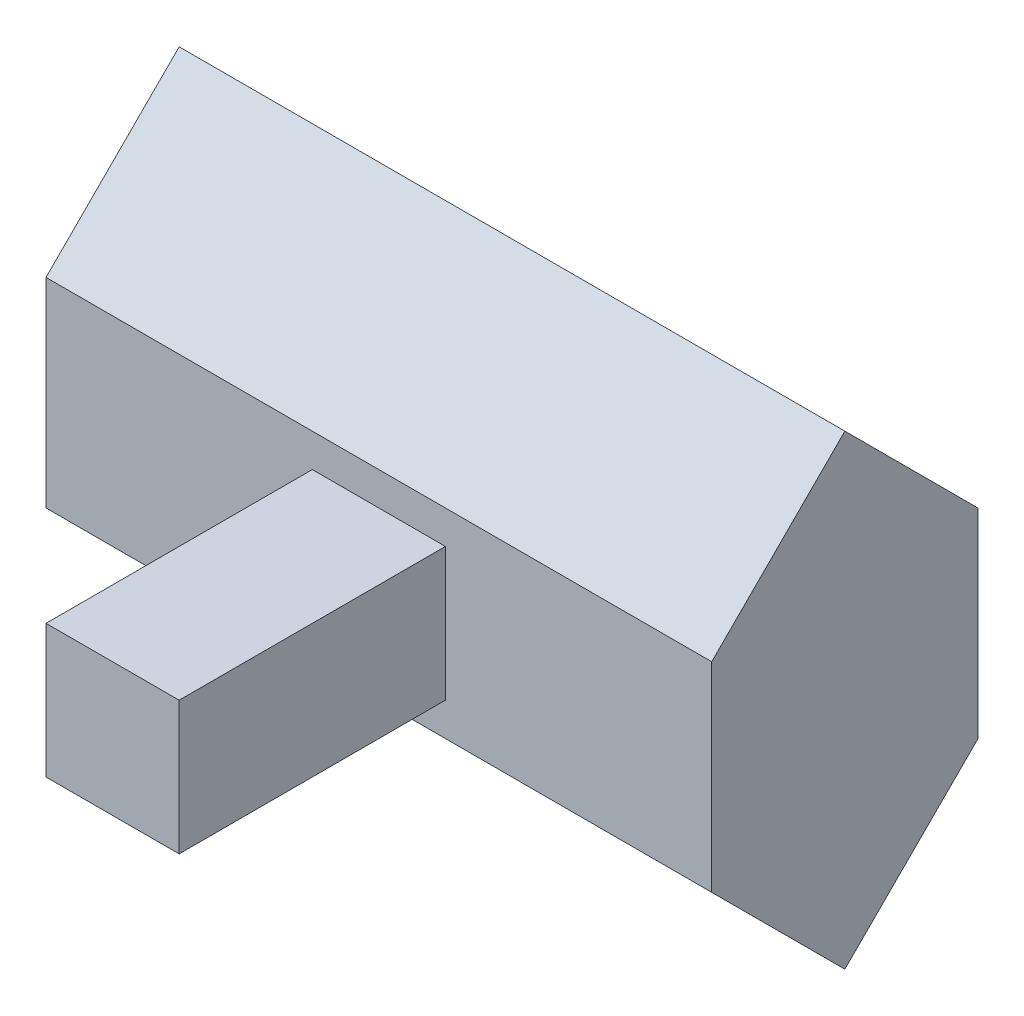
ISO-10303-21;
HEADER;
FILE_DESCRIPTION(('STEP AP214'),'2;1');
FILE_NAME('part.step','',(''),(''),'','','');
FILE_SCHEMA(('AUTOMOTIVE_DESIGN { 1 0 10303 214 1 1 1 1 }'));
ENDSEC;
DATA;
#1=APPLICATION_CONTEXT('core data for automotive mechanical design processes');
#2=APPLICATION_PROTOCOL_DEFINITION('international standard','automotive_design',2000,#1);
#3=PRODUCT_CONTEXT('',#1,'mechanical');
#4=PRODUCT('Part','Part','',(#3));
#5=PRODUCT_RELATED_PRODUCT_CATEGORY('part','',(#4));
#6=PRODUCT_DEFINITION_FORMATION('','',#4);
#7=PRODUCT_DEFINITION_CONTEXT('part definition',#1,'design');
#8=PRODUCT_DEFINITION('design','',#6,#7);
#9=PRODUCT_DEFINITION_SHAPE('','',#8);
#10=(LENGTH_UNIT() NAMED_UNIT(*) SI_UNIT(.MILLI.,.METRE.));
#11=(NAMED_UNIT(*) PLANE_ANGLE_UNIT() SI_UNIT($,.RADIAN.));
#12=(NAMED_UNIT(*) SI_UNIT($,.STERADIAN.) SOLID_ANGLE_UNIT());
#13=UNCERTAINTY_MEASURE_WITH_UNIT(LENGTH_MEASURE(1.E-05),#10,'distance_accuracy_value','');
#14=(GEOMETRIC_REPRESENTATION_CONTEXT(3) GLOBAL_UNCERTAINTY_ASSIGNED_CONTEXT((#13)) GLOBAL_UNIT_ASSIGNED_CONTEXT((#10,
#11,#12)) REPRESENTATION_CONTEXT('',''));
#15=CARTESIAN_POINT('',(0.,0.,0.));
#16=DIRECTION('',(0.,0.,1.));
#17=DIRECTION('',(1.,0.,0.));
#18=AXIS2_PLACEMENT_3D('',#15,#16,#17);
#19=CARTESIAN_POINT('',(0.,0.,200.));
#20=DIRECTION('',(0.,0.,-1.));
#21=DIRECTION('',(-1.,0.,0.));
#22=AXIS2_PLACEMENT_3D('',#19,#20,#21);
#23=PLANE('',#22);
#24=DIRECTION('',(0.,1.,0.));
#25=VECTOR('',#24,1.);
#26=CARTESIAN_POINT('',(500.,0.,200.));
#27=LINE('',#26,#25);
#28=CARTESIAN_POINT('',(500.,99.9999999999999,200.));
#29=VERTEX_POINT('',#28);
#30=CARTESIAN_POINT('',(500.,250.,200.));
#31=VERTEX_POINT('',#30);
#32=EDGE_CURVE('E219',#29,#31,#27,.T.);
#33=ORIENTED_EDGE('',*,*,#32,.T.);
#34=DIRECTION('',(-1.,0.,0.));
#35=VECTOR('',#34,1.);
#36=CARTESIAN_POINT('',(0.,250.,200.));
#37=LINE('',#36,#35);
#38=CARTESIAN_POINT('',(0.,250.,200.));
#39=VERTEX_POINT('',#38);
#40=EDGE_CURVE('E11',#31,#39,#37,.T.);
#41=ORIENTED_EDGE('',*,*,#40,.T.);
#42=DIRECTION('',(0.,-1.,0.));
#43=VECTOR('',#42,1.);
#44=CARTESIAN_POINT('',(0.,0.,200.));
#45=LINE('',#44,#43);
#46=CARTESIAN_POINT('',(0.,99.9999999999999,200.));
#47=VERTEX_POINT('',#46);
#48=EDGE_CURVE('E216',#39,#47,#45,.T.);
#49=ORIENTED_EDGE('',*,*,#48,.T.);
#50=DIRECTION('',(1.,0.,0.));
#51=VECTOR('',#50,1.);
#52=CARTESIAN_POINT('',(0.,99.9999999999999,200.));
#53=LINE('',#52,#51);
#54=EDGE_CURVE('E41',#47,#29,#53,.T.);
#55=ORIENTED_EDGE('',*,*,#54,.T.);
#56=EDGE_LOOP('',(#33,#41,#49,#55));
#57=FACE_BOUND('',#56,.T.);
#58=DIRECTION('',(0.,-1.,0.));
#59=VECTOR('',#58,1.);
#60=CARTESIAN_POINT('',(200.,225.,200.));
#61=LINE('',#60,#59);
#62=CARTESIAN_POINT('',(200.,225.,200.));
#63=VERTEX_POINT('',#62);
#64=CARTESIAN_POINT('',(200.,125.,200.));
#65=VERTEX_POINT('',#64);
#66=EDGE_CURVE('E49',#63,#65,#61,.T.);
#67=ORIENTED_EDGE('',*,*,#66,.F.);
#68=DIRECTION('',(-1.,0.,0.));
#69=VECTOR('',#68,1.);
#70=CARTESIAN_POINT('',(200.,225.,200.));
#71=LINE('',#70,#69);
#72=CARTESIAN_POINT('',(300.,225.,200.));
#73=VERTEX_POINT('',#72);
#74=EDGE_CURVE('E53',#73,#63,#71,.T.);
#75=ORIENTED_EDGE('',*,*,#74,.F.);
#76=DIRECTION('',(0.,1.,0.));
#77=VECTOR('',#76,1.);
#78=CARTESIAN_POINT('',(300.,225.,200.));
#79=LINE('',#78,#77);
#80=CARTESIAN_POINT('',(300.,125.,200.));
#81=VERTEX_POINT('',#80);
#82=EDGE_CURVE('E463',#81,#73,#79,.T.);
#83=ORIENTED_EDGE('',*,*,#82,.F.);
#84=DIRECTION('',(1.,0.,0.));
#85=VECTOR('',#84,1.);
#86=CARTESIAN_POINT('',(200.,125.,200.));
#87=LINE('',#86,#85);
#88=EDGE_CURVE('E469',#65,#81,#87,.T.);
#89=ORIENTED_EDGE('',*,*,#88,.F.);
#90=EDGE_LOOP('',(#67,#75,#83,#89));
#91=FACE_BOUND('',#90,.T.);
#92=ADVANCED_FACE('F32',(#57,#91),#23,.F.);
#93=CARTESIAN_POINT('',(0.,0.,0.));
#94=DIRECTION('',(0.,0.,-1.));
#95=DIRECTION('',(-1.,0.,0.));
#96=AXIS2_PLACEMENT_3D('',#93,#94,#95);
#97=PLANE('',#96);
#98=DIRECTION('',(0.,-1.,0.));
#99=VECTOR('',#98,1.);
#100=CARTESIAN_POINT('',(0.,0.,0.));
#101=LINE('',#100,#99);
#102=CARTESIAN_POINT('',(0.,250.,0.));
#103=VERTEX_POINT('',#102);
#104=CARTESIAN_POINT('',(0.,100.,0.));
#105=VERTEX_POINT('',#104);
#106=EDGE_CURVE('E224',#103,#105,#101,.T.);
#107=ORIENTED_EDGE('',*,*,#106,.F.);
#108=DIRECTION('',(1.,0.,0.));
#109=VECTOR('',#108,1.);
#110=CARTESIAN_POINT('',(500.,250.,0.));
#111=LINE('',#110,#109);
#112=CARTESIAN_POINT('',(500.,250.,0.));
#113=VERTEX_POINT('',#112);
#114=EDGE_CURVE('E240',#103,#113,#111,.T.);
#115=ORIENTED_EDGE('',*,*,#114,.T.);
#116=DIRECTION('',(0.,1.,0.));
#117=VECTOR('',#116,1.);
#118=CARTESIAN_POINT('',(500.,0.,0.));
#119=LINE('',#118,#117);
#120=CARTESIAN_POINT('',(500.,100.,0.));
#121=VERTEX_POINT('',#120);
#122=EDGE_CURVE('E220',#121,#113,#119,.T.);
#123=ORIENTED_EDGE('',*,*,#122,.F.);
#124=DIRECTION('',(-1.,0.,0.));
#125=VECTOR('',#124,1.);
#126=CARTESIAN_POINT('',(0.,100.,0.));
#127=LINE('',#126,#125);
#128=EDGE_CURVE('E237',#121,#105,#127,.T.);
#129=ORIENTED_EDGE('',*,*,#128,.T.);
#130=EDGE_LOOP('',(#107,#115,#123,#129));
#131=FACE_BOUND('',#130,.T.);
#132=DIRECTION('',(1.,0.,0.));
#133=VECTOR('',#132,1.);
#134=CARTESIAN_POINT('',(0.,242.928932188134,0.));
#135=LINE('',#134,#133);
#136=CARTESIAN_POINT('',(5.,242.928932188134,0.));
#137=VERTEX_POINT('',#136);
#138=CARTESIAN_POINT('',(495.,242.928932188134,0.));
#139=VERTEX_POINT('',#138);
#140=EDGE_CURVE('E202',#137,#139,#135,.T.);
#141=ORIENTED_EDGE('',*,*,#140,.F.);
#142=DIRECTION('',(0.,-1.,0.));
#143=VECTOR('',#142,1.);
#144=CARTESIAN_POINT('',(5.,0.,0.));
#145=LINE('',#144,#143);
#146=CARTESIAN_POINT('',(5.,107.071067811866,0.));
#147=VERTEX_POINT('',#146);
#148=EDGE_CURVE('E206',#137,#147,#145,.T.);
#149=ORIENTED_EDGE('',*,*,#148,.T.);
#150=DIRECTION('',(-1.,0.,0.));
#151=VECTOR('',#150,1.);
#152=CARTESIAN_POINT('',(0.,107.071067811866,0.));
#153=LINE('',#152,#151);
#154=CARTESIAN_POINT('',(495.,107.071067811866,0.));
#155=VERTEX_POINT('',#154);
#156=EDGE_CURVE('E180',#155,#147,#153,.T.);
#157=ORIENTED_EDGE('',*,*,#156,.F.);
#158=DIRECTION('',(0.,1.,0.));
#159=VECTOR('',#158,1.);
#160=CARTESIAN_POINT('',(495.,0.,0.));
#161=LINE('',#160,#159);
#162=EDGE_CURVE('E188',#155,#139,#161,.T.);
#163=ORIENTED_EDGE('',*,*,#162,.T.);
#164=EDGE_LOOP('',(#141,#149,#157,#163));
#165=FACE_BOUND('',#164,.T.);
#166=ADVANCED_FACE('F278',(#131,#165),#97,.T.);
#167=CARTESIAN_POINT('',(0.,0.,200.));
#168=DIRECTION('',(1.,0.,0.));
#169=DIRECTION('',(0.,0.,-1.));
#170=AXIS2_PLACEMENT_3D('',#167,#168,#169);
#171=PLANE('',#170);
#172=DIRECTION('',(0.,-0.707106781186546,0.707106781186549));
#173=VECTOR('',#172,1.);
#174=CARTESIAN_POINT('',(0.,250.,200.));
#175=LINE('',#174,#173);
#176=CARTESIAN_POINT('',(0.,350.,99.9999999999997));
#177=VERTEX_POINT('',#176);
#178=EDGE_CURVE('E233',#39,#177,#175,.F.);
#179=ORIENTED_EDGE('',*,*,#178,.T.);
#180=DIRECTION('',(0.,-0.707106781186549,-0.707106781186546));
#181=VECTOR('',#180,1.);
#182=CARTESIAN_POINT('',(0.,350.,100.));
#183=LINE('',#182,#181);
#184=EDGE_CURVE('E235',#177,#103,#183,.T.);
#185=ORIENTED_EDGE('',*,*,#184,.T.);
#186=ORIENTED_EDGE('',*,*,#106,.T.);
#187=DIRECTION('',(0.,-0.707106781186549,0.707106781186546));
#188=VECTOR('',#187,1.);
#189=CARTESIAN_POINT('',(0.,0.,100.));
#190=LINE('',#189,#188);
#191=CARTESIAN_POINT('',(0.,0.,99.9999999999998));
#192=VERTEX_POINT('',#191);
#193=EDGE_CURVE('E231',#105,#192,#190,.T.);
#194=ORIENTED_EDGE('',*,*,#193,.T.);
#195=DIRECTION('',(0.,-0.707106781186546,-0.707106781186549));
#196=VECTOR('',#195,1.);
#197=CARTESIAN_POINT('',(0.,99.9999999999999,200.));
#198=LINE('',#197,#196);
#199=EDGE_CURVE('E223',#192,#47,#198,.F.);
#200=ORIENTED_EDGE('',*,*,#199,.T.);
#201=ORIENTED_EDGE('',*,*,#48,.F.);
#202=EDGE_LOOP('',(#179,#185,#186,#194,#200,#201));
#203=FACE_BOUND('',#202,.T.);
#204=ADVANCED_FACE('F267',(#203),#171,.F.);
#205=CARTESIAN_POINT('',(500.,0.,200.));
#206=DIRECTION('',(-1.,0.,0.));
#207=DIRECTION('',(0.,0.,1.));
#208=AXIS2_PLACEMENT_3D('',#205,#206,#207);
#209=PLANE('',#208);
#210=ORIENTED_EDGE('',*,*,#122,.T.);
#211=DIRECTION('',(0.,0.707106781186549,0.707106781186546));
#212=VECTOR('',#211,1.);
#213=CARTESIAN_POINT('',(500.,350.,100.));
#214=LINE('',#213,#212);
#215=CARTESIAN_POINT('',(500.,350.,99.9999999999997));
#216=VERTEX_POINT('',#215);
#217=EDGE_CURVE('E249',#113,#216,#214,.T.);
#218=ORIENTED_EDGE('',*,*,#217,.T.);
#219=DIRECTION('',(0.,0.707106781186546,-0.707106781186549));
#220=VECTOR('',#219,1.);
#221=CARTESIAN_POINT('',(500.,250.,200.));
#222=LINE('',#221,#220);
#223=EDGE_CURVE('E247',#216,#31,#222,.F.);
#224=ORIENTED_EDGE('',*,*,#223,.T.);
#225=ORIENTED_EDGE('',*,*,#32,.F.);
#226=DIRECTION('',(0.,0.707106781186546,0.707106781186549));
#227=VECTOR('',#226,1.);
#228=CARTESIAN_POINT('',(500.,99.9999999999999,200.));
#229=LINE('',#228,#227);
#230=CARTESIAN_POINT('',(500.,0.,99.9999999999998));
#231=VERTEX_POINT('',#230);
#232=EDGE_CURVE('E243',#29,#231,#229,.F.);
#233=ORIENTED_EDGE('',*,*,#232,.T.);
#234=DIRECTION('',(0.,0.707106781186549,-0.707106781186546));
#235=VECTOR('',#234,1.);
#236=CARTESIAN_POINT('',(500.,0.,100.));
#237=LINE('',#236,#235);
#238=EDGE_CURVE('E245',#231,#121,#237,.T.);
#239=ORIENTED_EDGE('',*,*,#238,.T.);
#240=EDGE_LOOP('',(#210,#218,#224,#225,#233,#239));
#241=FACE_BOUND('',#240,.T.);
#242=ADVANCED_FACE('F283',(#241),#209,.F.);
#243=CARTESIAN_POINT('',(0.,250.,200.));
#244=DIRECTION('',(0.,-0.707106781186549,-0.707106781186546));
#245=DIRECTION('',(-1.,0.,0.));
#246=AXIS2_PLACEMENT_3D('',#243,#244,#245);
#247=PLANE('',#246);
#248=ORIENTED_EDGE('',*,*,#40,.F.);
#249=ORIENTED_EDGE('',*,*,#223,.F.);
#250=DIRECTION('',(1.,0.,0.));
#251=VECTOR('',#250,1.);
#252=CARTESIAN_POINT('',(0.,350.,99.9999999999997));
#253=LINE('',#252,#251);
#254=EDGE_CURVE('E227',#177,#216,#253,.T.);
#255=ORIENTED_EDGE('',*,*,#254,.F.);
#256=ORIENTED_EDGE('',*,*,#178,.F.);
#257=EDGE_LOOP('',(#248,#249,#255,#256));
#258=FACE_BOUND('',#257,.T.);
#259=ADVANCED_FACE('F274',(#258),#247,.F.);
#260=CARTESIAN_POINT('',(0.,350.,100.));
#261=DIRECTION('',(0.,0.707106781186547,-0.707106781186549));
#262=DIRECTION('',(1.,0.,0.));
#263=AXIS2_PLACEMENT_3D('',#260,#261,#262);
#264=PLANE('',#263);
#265=ORIENTED_EDGE('',*,*,#217,.F.);
#266=ORIENTED_EDGE('',*,*,#114,.F.);
#267=ORIENTED_EDGE('',*,*,#184,.F.);
#268=ORIENTED_EDGE('',*,*,#254,.T.);
#269=EDGE_LOOP('',(#265,#266,#267,#268));
#270=FACE_BOUND('',#269,.T.);
#271=ADVANCED_FACE('F281',(#270),#264,.T.);
#272=CARTESIAN_POINT('',(0.,99.9999999999999,200.));
#273=DIRECTION('',(0.,0.707106781186549,-0.707106781186546));
#274=DIRECTION('',(1.,0.,0.));
#275=AXIS2_PLACEMENT_3D('',#272,#273,#274);
#276=PLANE('',#275);
#277=ORIENTED_EDGE('',*,*,#54,.F.);
#278=ORIENTED_EDGE('',*,*,#199,.F.);
#279=DIRECTION('',(-1.,0.,0.));
#280=VECTOR('',#279,1.);
#281=CARTESIAN_POINT('',(0.,0.,99.9999999999998));
#282=LINE('',#281,#280);
#283=EDGE_CURVE('E36',#231,#192,#282,.T.);
#284=ORIENTED_EDGE('',*,*,#283,.F.);
#285=ORIENTED_EDGE('',*,*,#232,.F.);
#286=EDGE_LOOP('',(#277,#278,#284,#285));
#287=FACE_BOUND('',#286,.T.);
#288=ADVANCED_FACE('F34',(#287),#276,.F.);
#289=CARTESIAN_POINT('',(0.,0.,100.));
#290=DIRECTION('',(0.,-0.707106781186546,-0.707106781186549));
#291=DIRECTION('',(-1.,0.,0.));
#292=AXIS2_PLACEMENT_3D('',#289,#290,#291);
#293=PLANE('',#292);
#294=ORIENTED_EDGE('',*,*,#193,.F.);
#295=ORIENTED_EDGE('',*,*,#128,.F.);
#296=ORIENTED_EDGE('',*,*,#238,.F.);
#297=ORIENTED_EDGE('',*,*,#283,.T.);
#298=EDGE_LOOP('',(#294,#295,#296,#297));
#299=FACE_BOUND('',#298,.T.);
#300=ADVANCED_FACE('F259',(#299),#293,.T.);
#301=CARTESIAN_POINT('',(5.,0.,200.));
#302=DIRECTION('',(1.,0.,0.));
#303=DIRECTION('',(0.,0.,-1.));
#304=AXIS2_PLACEMENT_3D('',#301,#302,#303);
#305=PLANE('',#304);
#306=DIRECTION('',(0.,-0.707106781186546,0.707106781186549));
#307=VECTOR('',#306,1.);
#308=CARTESIAN_POINT('',(5.,246.464466094067,196.464466094067));
#309=LINE('',#308,#307);
#310=CARTESIAN_POINT('',(5.,247.928932188135,195.));
#311=VERTEX_POINT('',#310);
#312=CARTESIAN_POINT('',(5.,342.928932188134,99.9999999999999));
#313=VERTEX_POINT('',#312);
#314=EDGE_CURVE('E175',#311,#313,#309,.F.);
#315=ORIENTED_EDGE('',*,*,#314,.F.);
#316=DIRECTION('',(0.,-1.,0.));
#317=VECTOR('',#316,1.);
#318=CARTESIAN_POINT('',(5.,0.,195.));
#319=LINE('',#318,#317);
#320=CARTESIAN_POINT('',(5.,102.071067811865,195.));
#321=VERTEX_POINT('',#320);
#322=EDGE_CURVE('E185',#311,#321,#319,.T.);
#323=ORIENTED_EDGE('',*,*,#322,.T.);
#324=DIRECTION('',(0.,-0.707106781186546,-0.707106781186549));
#325=VECTOR('',#324,1.);
#326=CARTESIAN_POINT('',(5.,103.535533905933,196.464466094067));
#327=LINE('',#326,#325);
#328=CARTESIAN_POINT('',(5.,7.07106781186561,99.9999999999999));
#329=VERTEX_POINT('',#328);
#330=EDGE_CURVE('E182',#329,#321,#327,.F.);
#331=ORIENTED_EDGE('',*,*,#330,.F.);
#332=DIRECTION('',(0.,-0.707106781186549,0.707106781186546));
#333=VECTOR('',#332,1.);
#334=CARTESIAN_POINT('',(5.,3.53553390593273,103.535533905933));
#335=LINE('',#334,#333);
#336=EDGE_CURVE('E178',#147,#329,#335,.T.);
#337=ORIENTED_EDGE('',*,*,#336,.F.);
#338=ORIENTED_EDGE('',*,*,#148,.F.);
#339=DIRECTION('',(0.,-0.707106781186549,-0.707106781186546));
#340=VECTOR('',#339,1.);
#341=CARTESIAN_POINT('',(5.,346.464466094067,103.535533905933));
#342=LINE('',#341,#340);
#343=EDGE_CURVE('E177',#313,#137,#342,.T.);
#344=ORIENTED_EDGE('',*,*,#343,.F.);
#345=EDGE_LOOP('',(#315,#323,#331,#337,#338,#344));
#346=FACE_BOUND('',#345,.T.);
#347=ADVANCED_FACE('F322',(#346),#305,.T.);
#348=CARTESIAN_POINT('',(495.,0.,200.));
#349=DIRECTION('',(-1.,0.,0.));
#350=DIRECTION('',(0.,0.,1.));
#351=AXIS2_PLACEMENT_3D('',#348,#349,#350);
#352=PLANE('',#351);
#353=ORIENTED_EDGE('',*,*,#162,.F.);
#354=DIRECTION('',(0.,0.707106781186549,-0.707106781186546));
#355=VECTOR('',#354,1.);
#356=CARTESIAN_POINT('',(495.,3.53553390593273,103.535533905933));
#357=LINE('',#356,#355);
#358=CARTESIAN_POINT('',(495.,7.07106781186561,99.9999999999999));
#359=VERTEX_POINT('',#358);
#360=EDGE_CURVE('E199',#359,#155,#357,.T.);
#361=ORIENTED_EDGE('',*,*,#360,.F.);
#362=DIRECTION('',(0.,0.707106781186546,0.707106781186549));
#363=VECTOR('',#362,1.);
#364=CARTESIAN_POINT('',(495.,103.535533905933,196.464466094067));
#365=LINE('',#364,#363);
#366=CARTESIAN_POINT('',(495.,102.071067811865,195.));
#367=VERTEX_POINT('',#366);
#368=EDGE_CURVE('E200',#367,#359,#365,.F.);
#369=ORIENTED_EDGE('',*,*,#368,.F.);
#370=DIRECTION('',(0.,1.,0.));
#371=VECTOR('',#370,1.);
#372=CARTESIAN_POINT('',(495.,0.,195.));
#373=LINE('',#372,#371);
#374=CARTESIAN_POINT('',(495.,247.928932188135,195.));
#375=VERTEX_POINT('',#374);
#376=EDGE_CURVE('E184',#367,#375,#373,.T.);
#377=ORIENTED_EDGE('',*,*,#376,.T.);
#378=DIRECTION('',(0.,0.707106781186546,-0.707106781186549));
#379=VECTOR('',#378,1.);
#380=CARTESIAN_POINT('',(495.,246.464466094067,196.464466094067));
#381=LINE('',#380,#379);
#382=CARTESIAN_POINT('',(495.,342.928932188134,99.9999999999999));
#383=VERTEX_POINT('',#382);
#384=EDGE_CURVE('E197',#383,#375,#381,.F.);
#385=ORIENTED_EDGE('',*,*,#384,.F.);
#386=DIRECTION('',(0.,0.707106781186549,0.707106781186546));
#387=VECTOR('',#386,1.);
#388=CARTESIAN_POINT('',(495.,346.464466094067,103.535533905933));
#389=LINE('',#388,#387);
#390=EDGE_CURVE('E195',#139,#383,#389,.T.);
#391=ORIENTED_EDGE('',*,*,#390,.F.);
#392=EDGE_LOOP('',(#353,#361,#369,#377,#385,#391));
#393=FACE_BOUND('',#392,.T.);
#394=ADVANCED_FACE('F318',(#393),#352,.T.);
#395=CARTESIAN_POINT('',(0.,0.,195.));
#396=DIRECTION('',(0.,0.,-1.));
#397=DIRECTION('',(-1.,0.,0.));
#398=AXIS2_PLACEMENT_3D('',#395,#396,#397);
#399=PLANE('',#398);
#400=ORIENTED_EDGE('',*,*,#376,.F.);
#401=DIRECTION('',(-1.,0.,0.));
#402=VECTOR('',#401,1.);
#403=CARTESIAN_POINT('',(0.,102.071067811865,195.));
#404=LINE('',#403,#402);
#405=EDGE_CURVE('E193',#321,#367,#404,.F.);
#406=ORIENTED_EDGE('',*,*,#405,.F.);
#407=ORIENTED_EDGE('',*,*,#322,.F.);
#408=DIRECTION('',(1.,0.,0.));
#409=VECTOR('',#408,1.);
#410=CARTESIAN_POINT('',(0.,247.928932188135,195.));
#411=LINE('',#410,#409);
#412=EDGE_CURVE('E191',#375,#311,#411,.F.);
#413=ORIENTED_EDGE('',*,*,#412,.F.);
#414=EDGE_LOOP('',(#400,#406,#407,#413));
#415=FACE_BOUND('',#414,.T.);
#416=ADVANCED_FACE('F314',(#415),#399,.T.);
#417=CARTESIAN_POINT('',(0.,246.464466094067,196.464466094067));
#418=DIRECTION('',(0.,-0.707106781186549,-0.707106781186546));
#419=DIRECTION('',(-1.,0.,0.));
#420=AXIS2_PLACEMENT_3D('',#417,#418,#419);
#421=PLANE('',#420);
#422=ORIENTED_EDGE('',*,*,#412,.T.);
#423=ORIENTED_EDGE('',*,*,#314,.T.);
#424=DIRECTION('',(-1.,0.,0.));
#425=VECTOR('',#424,1.);
#426=CARTESIAN_POINT('',(0.,342.928932188134,99.9999999999999));
#427=LINE('',#426,#425);
#428=EDGE_CURVE('E169',#313,#383,#427,.F.);
#429=ORIENTED_EDGE('',*,*,#428,.T.);
#430=ORIENTED_EDGE('',*,*,#384,.T.);
#431=EDGE_LOOP('',(#422,#423,#429,#430));
#432=FACE_BOUND('',#431,.T.);
#433=ADVANCED_FACE('F310',(#432),#421,.T.);
#434=CARTESIAN_POINT('',(0.,346.464466094067,103.535533905933));
#435=DIRECTION('',(0.,0.707106781186547,-0.707106781186549));
#436=DIRECTION('',(1.,0.,0.));
#437=AXIS2_PLACEMENT_3D('',#434,#435,#436);
#438=PLANE('',#437);
#439=ORIENTED_EDGE('',*,*,#390,.T.);
#440=ORIENTED_EDGE('',*,*,#428,.F.);
#441=ORIENTED_EDGE('',*,*,#343,.T.);
#442=ORIENTED_EDGE('',*,*,#140,.T.);
#443=EDGE_LOOP('',(#439,#440,#441,#442));
#444=FACE_BOUND('',#443,.T.);
#445=ADVANCED_FACE('F306',(#444),#438,.F.);
#446=CARTESIAN_POINT('',(0.,103.535533905933,196.464466094067));
#447=DIRECTION('',(0.,0.707106781186549,-0.707106781186546));
#448=DIRECTION('',(1.,0.,0.));
#449=AXIS2_PLACEMENT_3D('',#446,#447,#448);
#450=PLANE('',#449);
#451=ORIENTED_EDGE('',*,*,#405,.T.);
#452=ORIENTED_EDGE('',*,*,#368,.T.);
#453=DIRECTION('',(1.,0.,0.));
#454=VECTOR('',#453,1.);
#455=CARTESIAN_POINT('',(0.,7.07106781186561,99.9999999999999));
#456=LINE('',#455,#454);
#457=EDGE_CURVE('E166',#359,#329,#456,.F.);
#458=ORIENTED_EDGE('',*,*,#457,.T.);
#459=ORIENTED_EDGE('',*,*,#330,.T.);
#460=EDGE_LOOP('',(#451,#452,#458,#459));
#461=FACE_BOUND('',#460,.T.);
#462=ADVANCED_FACE('F302',(#461),#450,.T.);
#463=CARTESIAN_POINT('',(0.,3.53553390593273,103.535533905933));
#464=DIRECTION('',(0.,-0.707106781186546,-0.707106781186549));
#465=DIRECTION('',(-1.,0.,0.));
#466=AXIS2_PLACEMENT_3D('',#463,#464,#465);
#467=PLANE('',#466);
#468=ORIENTED_EDGE('',*,*,#336,.T.);
#469=ORIENTED_EDGE('',*,*,#457,.F.);
#470=ORIENTED_EDGE('',*,*,#360,.T.);
#471=ORIENTED_EDGE('',*,*,#156,.T.);
#472=EDGE_LOOP('',(#468,#469,#470,#471));
#473=FACE_BOUND('',#472,.T.);
#474=ADVANCED_FACE('F299',(#473),#467,.F.);
#475=CARTESIAN_POINT('',(200.,225.,400.));
#476=DIRECTION('',(1.,0.,0.));
#477=DIRECTION('',(0.,0.,-1.));
#478=AXIS2_PLACEMENT_3D('',#475,#476,#477);
#479=PLANE('',#478);
#480=ORIENTED_EDGE('',*,*,#66,.T.);
#481=DIRECTION('',(0.,0.,-1.));
#482=VECTOR('',#481,1.);
#483=CARTESIAN_POINT('',(200.,125.,400.));
#484=LINE('',#483,#482);
#485=CARTESIAN_POINT('',(200.,125.,400.));
#486=VERTEX_POINT('',#485);
#487=EDGE_CURVE('E149',#486,#65,#484,.T.);
#488=ORIENTED_EDGE('',*,*,#487,.F.);
#489=DIRECTION('',(0.,-1.,0.));
#490=VECTOR('',#489,1.);
#491=CARTESIAN_POINT('',(200.,225.,400.));
#492=LINE('',#491,#490);
#493=CARTESIAN_POINT('',(200.,225.,400.));
#494=VERTEX_POINT('',#493);
#495=EDGE_CURVE('E155',#494,#486,#492,.T.);
#496=ORIENTED_EDGE('',*,*,#495,.F.);
#497=DIRECTION('',(0.,0.,-1.));
#498=VECTOR('',#497,1.);
#499=CARTESIAN_POINT('',(200.,225.,400.));
#500=LINE('',#499,#498);
#501=EDGE_CURVE('E461',#494,#63,#500,.T.);
#502=ORIENTED_EDGE('',*,*,#501,.T.);
#503=EDGE_LOOP('',(#480,#488,#496,#502));
#504=FACE_BOUND('',#503,.T.);
#505=ADVANCED_FACE('F165',(#504),#479,.F.);
#506=CARTESIAN_POINT('',(200.,125.,400.));
#507=DIRECTION('',(0.,1.,0.));
#508=DIRECTION('',(-1.,0.,0.));
#509=AXIS2_PLACEMENT_3D('',#506,#507,#508);
#510=PLANE('',#509);
#511=ORIENTED_EDGE('',*,*,#88,.T.);
#512=DIRECTION('',(0.,0.,-1.));
#513=VECTOR('',#512,1.);
#514=CARTESIAN_POINT('',(300.,125.,400.));
#515=LINE('',#514,#513);
#516=CARTESIAN_POINT('',(300.,125.,400.));
#517=VERTEX_POINT('',#516);
#518=EDGE_CURVE('E151',#517,#81,#515,.T.);
#519=ORIENTED_EDGE('',*,*,#518,.F.);
#520=DIRECTION('',(1.,0.,0.));
#521=VECTOR('',#520,1.);
#522=CARTESIAN_POINT('',(200.,125.,400.));
#523=LINE('',#522,#521);
#524=EDGE_CURVE('E144',#486,#517,#523,.T.);
#525=ORIENTED_EDGE('',*,*,#524,.F.);
#526=ORIENTED_EDGE('',*,*,#487,.T.);
#527=EDGE_LOOP('',(#511,#519,#525,#526));
#528=FACE_BOUND('',#527,.T.);
#529=ADVANCED_FACE('F147',(#528),#510,.F.);
#530=CARTESIAN_POINT('',(300.,225.,400.));
#531=DIRECTION('',(-1.,0.,0.));
#532=DIRECTION('',(0.,0.,1.));
#533=AXIS2_PLACEMENT_3D('',#530,#531,#532);
#534=PLANE('',#533);
#535=ORIENTED_EDGE('',*,*,#82,.T.);
#536=DIRECTION('',(0.,0.,-1.));
#537=VECTOR('',#536,1.);
#538=CARTESIAN_POINT('',(300.,225.,400.));
#539=LINE('',#538,#537);
#540=CARTESIAN_POINT('',(300.,225.,400.));
#541=VERTEX_POINT('',#540);
#542=EDGE_CURVE('E171',#541,#73,#539,.T.);
#543=ORIENTED_EDGE('',*,*,#542,.F.);
#544=DIRECTION('',(0.,1.,0.));
#545=VECTOR('',#544,1.);
#546=CARTESIAN_POINT('',(300.,225.,400.));
#547=LINE('',#546,#545);
#548=EDGE_CURVE('E154',#517,#541,#547,.T.);
#549=ORIENTED_EDGE('',*,*,#548,.F.);
#550=ORIENTED_EDGE('',*,*,#518,.T.);
#551=EDGE_LOOP('',(#535,#543,#549,#550));
#552=FACE_BOUND('',#551,.T.);
#553=ADVANCED_FACE('F331',(#552),#534,.F.);
#554=CARTESIAN_POINT('',(200.,225.,400.));
#555=DIRECTION('',(0.,-1.,0.));
#556=DIRECTION('',(0.,0.,-1.));
#557=AXIS2_PLACEMENT_3D('',#554,#555,#556);
#558=PLANE('',#557);
#559=ORIENTED_EDGE('',*,*,#74,.T.);
#560=ORIENTED_EDGE('',*,*,#501,.F.);
#561=DIRECTION('',(-1.,0.,0.));
#562=VECTOR('',#561,1.);
#563=CARTESIAN_POINT('',(200.,225.,400.));
#564=LINE('',#563,#562);
#565=EDGE_CURVE('E160',#541,#494,#564,.T.);
#566=ORIENTED_EDGE('',*,*,#565,.F.);
#567=ORIENTED_EDGE('',*,*,#542,.T.);
#568=EDGE_LOOP('',(#559,#560,#566,#567));
#569=FACE_BOUND('',#568,.T.);
#570=ADVANCED_FACE('F334',(#569),#558,.F.);
#571=CARTESIAN_POINT('',(0.,0.,400.));
#572=DIRECTION('',(0.,0.,1.));
#573=DIRECTION('',(1.,0.,0.));
#574=AXIS2_PLACEMENT_3D('',#571,#572,#573);
#575=PLANE('',#574);
#576=ORIENTED_EDGE('',*,*,#495,.T.);
#577=ORIENTED_EDGE('',*,*,#524,.T.);
#578=ORIENTED_EDGE('',*,*,#548,.T.);
#579=ORIENTED_EDGE('',*,*,#565,.T.);
#580=EDGE_LOOP('',(#576,#577,#578,#579));
#581=FACE_BOUND('',#580,.T.);
#582=ADVANCED_FACE('F158',(#581),#575,.T.);
#583=CLOSED_SHELL('',(#92,#166,#204,#242,#259,#271,#288,#300,#347,#394,#416,#433,#445,#462,#474,
#505,#529,#553,#570,#582));
#584=MANIFOLD_SOLID_BREP('B2',#583);
#585=ADVANCED_BREP_SHAPE_REPRESENTATION('',(#18,#584),#14);
#586=SHAPE_DEFINITION_REPRESENTATION(#9,#585);
ENDSEC;
END-ISO-10303-21;
